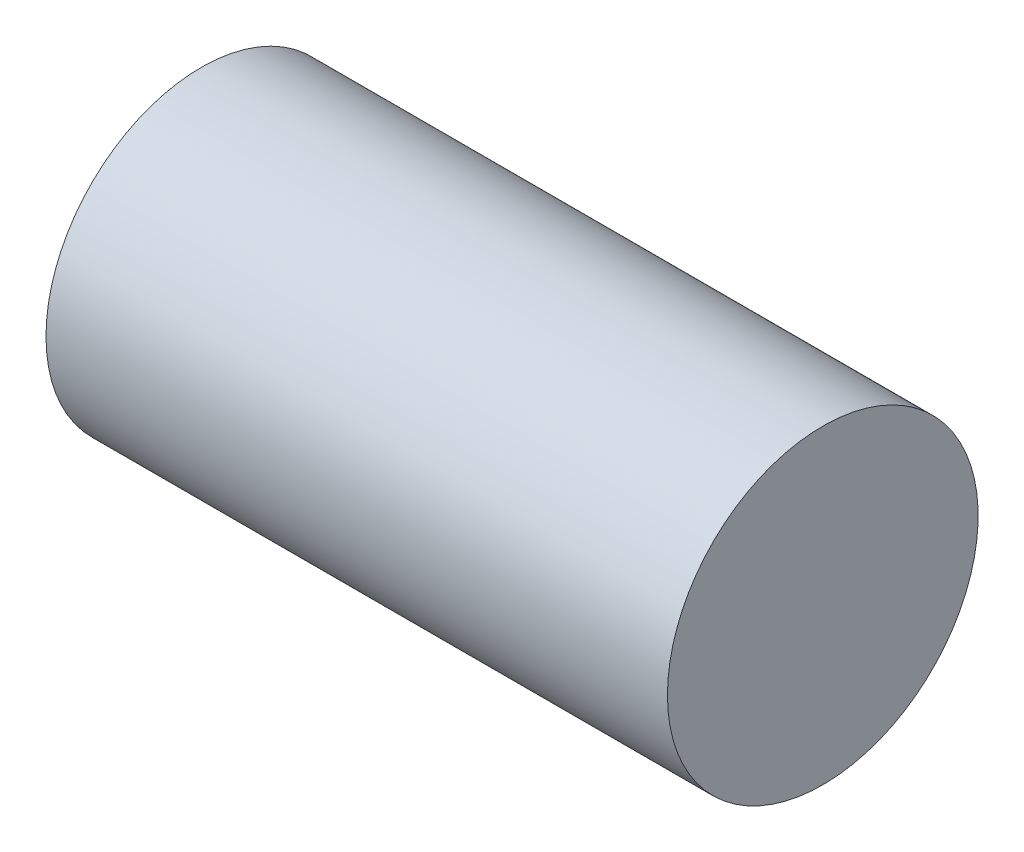
ISO-10303-21;
HEADER;
FILE_DESCRIPTION(('STEP AP214'),'2;1');
FILE_NAME('part.step','',(''),(''),'','','');
FILE_SCHEMA(('AUTOMOTIVE_DESIGN { 1 0 10303 214 1 1 1 1 }'));
ENDSEC;
DATA;
#1=APPLICATION_CONTEXT('core data for automotive mechanical design processes');
#2=APPLICATION_PROTOCOL_DEFINITION('international standard','automotive_design',2000,#1);
#3=PRODUCT_CONTEXT('',#1,'mechanical');
#4=PRODUCT('Part','Part','',(#3));
#5=PRODUCT_RELATED_PRODUCT_CATEGORY('part','',(#4));
#6=PRODUCT_DEFINITION_FORMATION('','',#4);
#7=PRODUCT_DEFINITION_CONTEXT('part definition',#1,'design');
#8=PRODUCT_DEFINITION('design','',#6,#7);
#9=PRODUCT_DEFINITION_SHAPE('','',#8);
#10=(LENGTH_UNIT() NAMED_UNIT(*) SI_UNIT(.MILLI.,.METRE.));
#11=(NAMED_UNIT(*) PLANE_ANGLE_UNIT() SI_UNIT($,.RADIAN.));
#12=(NAMED_UNIT(*) SI_UNIT($,.STERADIAN.) SOLID_ANGLE_UNIT());
#13=UNCERTAINTY_MEASURE_WITH_UNIT(LENGTH_MEASURE(1.E-05),#10,'distance_accuracy_value','');
#14=(GEOMETRIC_REPRESENTATION_CONTEXT(3) GLOBAL_UNCERTAINTY_ASSIGNED_CONTEXT((#13)) GLOBAL_UNIT_ASSIGNED_CONTEXT((#10,
#11,#12)) REPRESENTATION_CONTEXT('',''));
#15=CARTESIAN_POINT('',(0.,0.,0.));
#16=DIRECTION('',(0.,0.,1.));
#17=DIRECTION('',(1.,0.,0.));
#18=AXIS2_PLACEMENT_3D('',#15,#16,#17);
#19=CARTESIAN_POINT('',(0.,0.,0.));
#20=DIRECTION('',(-1.,0.,0.));
#21=DIRECTION('',(0.,0.,1.));
#22=AXIS2_PLACEMENT_3D('',#19,#20,#21);
#23=PLANE('',#22);
#24=CARTESIAN_POINT('',(0.,10.,0.));
#25=DIRECTION('',(-1.,0.,0.));
#26=DIRECTION('',(0.,0.,1.));
#27=AXIS2_PLACEMENT_3D('',#24,#25,#26);
#28=CIRCLE('',#27,10.);
#29=CARTESIAN_POINT('',(0.,10.,10.));
#30=VERTEX_POINT('',#29);
#31=EDGE_CURVE('E41',#30,#30,#28,.T.);
#32=ORIENTED_EDGE('',*,*,#31,.T.);
#33=EDGE_LOOP('',(#32));
#34=FACE_BOUND('',#33,.T.);
#35=ADVANCED_FACE('F35',(#34),#23,.T.);
#36=CARTESIAN_POINT('',(40.,0.,0.));
#37=DIRECTION('',(1.,0.,0.));
#38=DIRECTION('',(0.,0.,-1.));
#39=AXIS2_PLACEMENT_3D('',#36,#37,#38);
#40=PLANE('',#39);
#41=CARTESIAN_POINT('',(40.,10.,0.));
#42=DIRECTION('',(-1.,0.,0.));
#43=DIRECTION('',(0.,0.,1.));
#44=AXIS2_PLACEMENT_3D('',#41,#42,#43);
#45=CIRCLE('',#44,10.);
#46=CARTESIAN_POINT('',(40.,10.,10.));
#47=VERTEX_POINT('',#46);
#48=EDGE_CURVE('E10',#47,#47,#45,.T.);
#49=ORIENTED_EDGE('',*,*,#48,.F.);
#50=EDGE_LOOP('',(#49));
#51=FACE_BOUND('',#50,.T.);
#52=ADVANCED_FACE('F50',(#51),#40,.T.);
#53=CARTESIAN_POINT('',(0.,10.,0.));
#54=DIRECTION('',(-1.,0.,0.));
#55=DIRECTION('',(0.,0.,1.));
#56=AXIS2_PLACEMENT_3D('',#53,#54,#55);
#57=CYLINDRICAL_SURFACE('',#56,10.);
#58=ORIENTED_EDGE('',*,*,#48,.T.);
#59=EDGE_LOOP('',(#58));
#60=FACE_BOUND('',#59,.T.);
#61=ORIENTED_EDGE('',*,*,#31,.F.);
#62=EDGE_LOOP('',(#61));
#63=FACE_BOUND('',#62,.T.);
#64=ADVANCED_FACE('F48',(#60,#63),#57,.T.);
#65=CLOSED_SHELL('',(#35,#52,#64));
#66=MANIFOLD_SOLID_BREP('B2',#65);
#67=ADVANCED_BREP_SHAPE_REPRESENTATION('',(#18,#66),#14);
#68=SHAPE_DEFINITION_REPRESENTATION(#9,#67);
ENDSEC;
END-ISO-10303-21;
